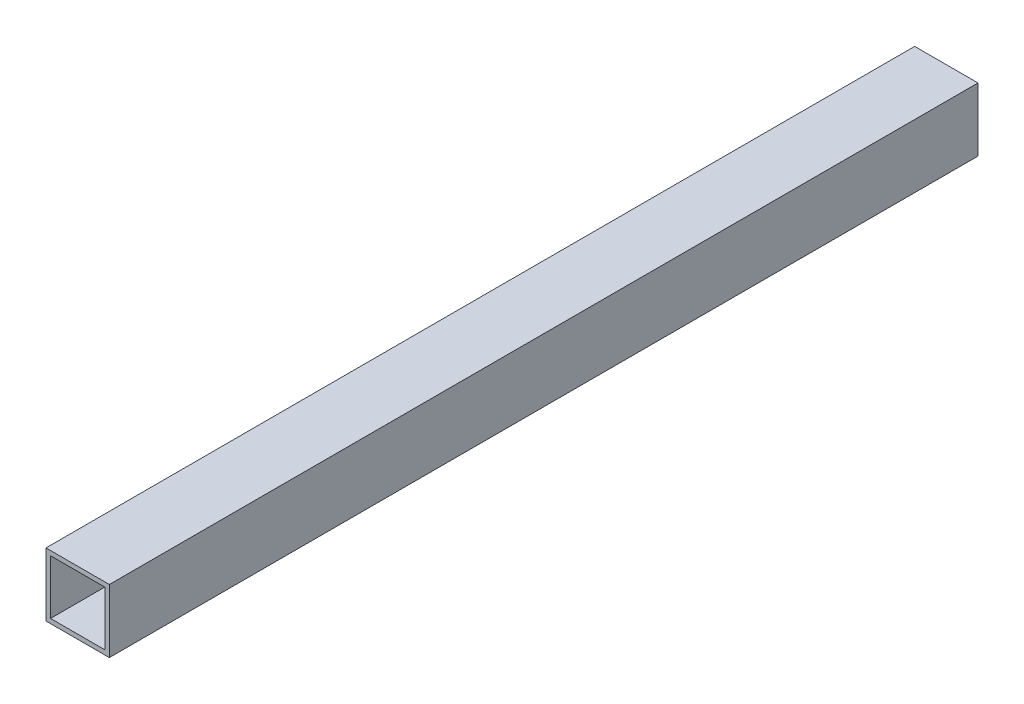
ISO-10303-21;
HEADER;
FILE_DESCRIPTION(('STEP AP214'),'2;1');
FILE_NAME('part.step','',(''),(''),'','','');
FILE_SCHEMA(('AUTOMOTIVE_DESIGN { 1 0 10303 214 1 1 1 1 }'));
ENDSEC;
DATA;
#1=APPLICATION_CONTEXT('core data for automotive mechanical design processes');
#2=APPLICATION_PROTOCOL_DEFINITION('international standard','automotive_design',2000,#1);
#3=PRODUCT_CONTEXT('',#1,'mechanical');
#4=PRODUCT('Part','Part','',(#3));
#5=PRODUCT_RELATED_PRODUCT_CATEGORY('part','',(#4));
#6=PRODUCT_DEFINITION_FORMATION('','',#4);
#7=PRODUCT_DEFINITION_CONTEXT('part definition',#1,'design');
#8=PRODUCT_DEFINITION('design','',#6,#7);
#9=PRODUCT_DEFINITION_SHAPE('','',#8);
#10=(LENGTH_UNIT() NAMED_UNIT(*) SI_UNIT(.MILLI.,.METRE.));
#11=(NAMED_UNIT(*) PLANE_ANGLE_UNIT() SI_UNIT($,.RADIAN.));
#12=(NAMED_UNIT(*) SI_UNIT($,.STERADIAN.) SOLID_ANGLE_UNIT());
#13=UNCERTAINTY_MEASURE_WITH_UNIT(LENGTH_MEASURE(1.E-05),#10,'distance_accuracy_value','');
#14=(GEOMETRIC_REPRESENTATION_CONTEXT(3) GLOBAL_UNCERTAINTY_ASSIGNED_CONTEXT((#13)) GLOBAL_UNIT_ASSIGNED_CONTEXT((#10,
#11,#12)) REPRESENTATION_CONTEXT('',''));
#15=CARTESIAN_POINT('',(0.,0.,0.));
#16=DIRECTION('',(0.,0.,1.));
#17=DIRECTION('',(1.,0.,0.));
#18=AXIS2_PLACEMENT_3D('',#15,#16,#17);
#19=CARTESIAN_POINT('',(0.,0.,609.6));
#20=DIRECTION('',(0.,0.,-1.));
#21=DIRECTION('',(-1.,0.,0.));
#22=AXIS2_PLACEMENT_3D('',#19,#20,#21);
#23=PLANE('',#22);
#24=DIRECTION('',(0.,-1.,0.));
#25=VECTOR('',#24,1.);
#26=CARTESIAN_POINT('',(0.,0.,609.6));
#27=LINE('',#26,#25);
#28=CARTESIAN_POINT('',(0.,44.45,609.6));
#29=VERTEX_POINT('',#28);
#30=CARTESIAN_POINT('',(0.,0.,609.6));
#31=VERTEX_POINT('',#30);
#32=EDGE_CURVE('E137',#29,#31,#27,.T.);
#33=ORIENTED_EDGE('',*,*,#32,.T.);
#34=DIRECTION('',(1.,0.,0.));
#35=VECTOR('',#34,1.);
#36=CARTESIAN_POINT('',(0.,0.,609.6));
#37=LINE('',#36,#35);
#38=CARTESIAN_POINT('',(44.45,0.,609.6));
#39=VERTEX_POINT('',#38);
#40=EDGE_CURVE('E140',#31,#39,#37,.T.);
#41=ORIENTED_EDGE('',*,*,#40,.T.);
#42=DIRECTION('',(0.,1.,0.));
#43=VECTOR('',#42,1.);
#44=CARTESIAN_POINT('',(44.45,0.,609.6));
#45=LINE('',#44,#43);
#46=CARTESIAN_POINT('',(44.45,44.45,609.6));
#47=VERTEX_POINT('',#46);
#48=EDGE_CURVE('E143',#39,#47,#45,.T.);
#49=ORIENTED_EDGE('',*,*,#48,.T.);
#50=DIRECTION('',(-1.,0.,0.));
#51=VECTOR('',#50,1.);
#52=CARTESIAN_POINT('',(0.,44.45,609.6));
#53=LINE('',#52,#51);
#54=EDGE_CURVE('E145',#47,#29,#53,.T.);
#55=ORIENTED_EDGE('',*,*,#54,.T.);
#56=EDGE_LOOP('',(#33,#41,#49,#55));
#57=FACE_BOUND('',#56,.T.);
#58=DIRECTION('',(1.,0.,0.));
#59=VECTOR('',#58,1.);
#60=CARTESIAN_POINT('',(3.175,3.175,609.6));
#61=LINE('',#60,#59);
#62=CARTESIAN_POINT('',(3.175,3.175,609.6));
#63=VERTEX_POINT('',#62);
#64=CARTESIAN_POINT('',(41.275,3.175,609.6));
#65=VERTEX_POINT('',#64);
#66=EDGE_CURVE('E101',#63,#65,#61,.T.);
#67=ORIENTED_EDGE('',*,*,#66,.F.);
#68=DIRECTION('',(0.,-1.,0.));
#69=VECTOR('',#68,1.);
#70=CARTESIAN_POINT('',(3.175,3.175,609.6));
#71=LINE('',#70,#69);
#72=CARTESIAN_POINT('',(3.175,41.275,609.6));
#73=VERTEX_POINT('',#72);
#74=EDGE_CURVE('E123',#73,#63,#71,.T.);
#75=ORIENTED_EDGE('',*,*,#74,.F.);
#76=DIRECTION('',(-1.,0.,0.));
#77=VECTOR('',#76,1.);
#78=CARTESIAN_POINT('',(3.175,41.275,609.6));
#79=LINE('',#78,#77);
#80=CARTESIAN_POINT('',(41.275,41.275,609.6));
#81=VERTEX_POINT('',#80);
#82=EDGE_CURVE('E121',#81,#73,#79,.T.);
#83=ORIENTED_EDGE('',*,*,#82,.F.);
#84=DIRECTION('',(0.,1.,0.));
#85=VECTOR('',#84,1.);
#86=CARTESIAN_POINT('',(41.275,3.175,609.6));
#87=LINE('',#86,#85);
#88=EDGE_CURVE('E109',#65,#81,#87,.T.);
#89=ORIENTED_EDGE('',*,*,#88,.F.);
#90=EDGE_LOOP('',(#67,#75,#83,#89));
#91=FACE_BOUND('',#90,.T.);
#92=ADVANCED_FACE('F36',(#57,#91),#23,.F.);
#93=CARTESIAN_POINT('',(0.,0.,0.));
#94=DIRECTION('',(0.,0.,-1.));
#95=DIRECTION('',(-1.,0.,0.));
#96=AXIS2_PLACEMENT_3D('',#93,#94,#95);
#97=PLANE('',#96);
#98=DIRECTION('',(0.,-1.,0.));
#99=VECTOR('',#98,1.);
#100=CARTESIAN_POINT('',(0.,0.,0.));
#101=LINE('',#100,#99);
#102=CARTESIAN_POINT('',(0.,44.45,0.));
#103=VERTEX_POINT('',#102);
#104=CARTESIAN_POINT('',(0.,0.,0.));
#105=VERTEX_POINT('',#104);
#106=EDGE_CURVE('E117',#103,#105,#101,.T.);
#107=ORIENTED_EDGE('',*,*,#106,.F.);
#108=DIRECTION('',(-1.,0.,0.));
#109=VECTOR('',#108,1.);
#110=CARTESIAN_POINT('',(0.,44.45,0.));
#111=LINE('',#110,#109);
#112=CARTESIAN_POINT('',(44.45,44.45,0.));
#113=VERTEX_POINT('',#112);
#114=EDGE_CURVE('E141',#113,#103,#111,.T.);
#115=ORIENTED_EDGE('',*,*,#114,.F.);
#116=DIRECTION('',(0.,1.,0.));
#117=VECTOR('',#116,1.);
#118=CARTESIAN_POINT('',(44.45,0.,0.));
#119=LINE('',#118,#117);
#120=CARTESIAN_POINT('',(44.45,0.,0.));
#121=VERTEX_POINT('',#120);
#122=EDGE_CURVE('E152',#121,#113,#119,.T.);
#123=ORIENTED_EDGE('',*,*,#122,.F.);
#124=DIRECTION('',(1.,0.,0.));
#125=VECTOR('',#124,1.);
#126=CARTESIAN_POINT('',(0.,0.,0.));
#127=LINE('',#126,#125);
#128=EDGE_CURVE('E150',#105,#121,#127,.T.);
#129=ORIENTED_EDGE('',*,*,#128,.F.);
#130=EDGE_LOOP('',(#107,#115,#123,#129));
#131=FACE_BOUND('',#130,.T.);
#132=DIRECTION('',(0.,-1.,0.));
#133=VECTOR('',#132,1.);
#134=CARTESIAN_POINT('',(3.175,3.175,0.));
#135=LINE('',#134,#133);
#136=CARTESIAN_POINT('',(3.175,41.275,0.));
#137=VERTEX_POINT('',#136);
#138=CARTESIAN_POINT('',(3.175,3.175,0.));
#139=VERTEX_POINT('',#138);
#140=EDGE_CURVE('E110',#137,#139,#135,.T.);
#141=ORIENTED_EDGE('',*,*,#140,.T.);
#142=DIRECTION('',(1.,0.,0.));
#143=VECTOR('',#142,1.);
#144=CARTESIAN_POINT('',(3.175,3.175,0.));
#145=LINE('',#144,#143);
#146=CARTESIAN_POINT('',(41.275,3.175,0.));
#147=VERTEX_POINT('',#146);
#148=EDGE_CURVE('E59',#139,#147,#145,.T.);
#149=ORIENTED_EDGE('',*,*,#148,.T.);
#150=DIRECTION('',(0.,1.,0.));
#151=VECTOR('',#150,1.);
#152=CARTESIAN_POINT('',(41.275,3.175,0.));
#153=LINE('',#152,#151);
#154=CARTESIAN_POINT('',(41.275,41.275,0.));
#155=VERTEX_POINT('',#154);
#156=EDGE_CURVE('E116',#147,#155,#153,.T.);
#157=ORIENTED_EDGE('',*,*,#156,.T.);
#158=DIRECTION('',(-1.,0.,0.));
#159=VECTOR('',#158,1.);
#160=CARTESIAN_POINT('',(3.175,41.275,0.));
#161=LINE('',#160,#159);
#162=EDGE_CURVE('E129',#155,#137,#161,.T.);
#163=ORIENTED_EDGE('',*,*,#162,.T.);
#164=EDGE_LOOP('',(#141,#149,#157,#163));
#165=FACE_BOUND('',#164,.T.);
#166=ADVANCED_FACE('F170',(#131,#165),#97,.T.);
#167=CARTESIAN_POINT('',(0.,0.,609.6));
#168=DIRECTION('',(1.,0.,0.));
#169=DIRECTION('',(0.,0.,-1.));
#170=AXIS2_PLACEMENT_3D('',#167,#168,#169);
#171=PLANE('',#170);
#172=ORIENTED_EDGE('',*,*,#106,.T.);
#173=DIRECTION('',(0.,0.,-1.));
#174=VECTOR('',#173,1.);
#175=CARTESIAN_POINT('',(0.,0.,609.6));
#176=LINE('',#175,#174);
#177=EDGE_CURVE('E11',#31,#105,#176,.T.);
#178=ORIENTED_EDGE('',*,*,#177,.F.);
#179=ORIENTED_EDGE('',*,*,#32,.F.);
#180=DIRECTION('',(0.,0.,-1.));
#181=VECTOR('',#180,1.);
#182=CARTESIAN_POINT('',(0.,44.45,609.6));
#183=LINE('',#182,#181);
#184=EDGE_CURVE('E147',#29,#103,#183,.T.);
#185=ORIENTED_EDGE('',*,*,#184,.T.);
#186=EDGE_LOOP('',(#172,#178,#179,#185));
#187=FACE_BOUND('',#186,.T.);
#188=ADVANCED_FACE('F38',(#187),#171,.F.);
#189=CARTESIAN_POINT('',(0.,0.,609.6));
#190=DIRECTION('',(0.,1.,0.));
#191=DIRECTION('',(0.,0.,1.));
#192=AXIS2_PLACEMENT_3D('',#189,#190,#191);
#193=PLANE('',#192);
#194=ORIENTED_EDGE('',*,*,#128,.T.);
#195=DIRECTION('',(0.,0.,-1.));
#196=VECTOR('',#195,1.);
#197=CARTESIAN_POINT('',(44.45,0.,609.6));
#198=LINE('',#197,#196);
#199=EDGE_CURVE('E44',#39,#121,#198,.T.);
#200=ORIENTED_EDGE('',*,*,#199,.F.);
#201=ORIENTED_EDGE('',*,*,#40,.F.);
#202=ORIENTED_EDGE('',*,*,#177,.T.);
#203=EDGE_LOOP('',(#194,#200,#201,#202));
#204=FACE_BOUND('',#203,.T.);
#205=ADVANCED_FACE('F180',(#204),#193,.F.);
#206=CARTESIAN_POINT('',(44.45,0.,609.6));
#207=DIRECTION('',(-1.,0.,0.));
#208=DIRECTION('',(0.,0.,1.));
#209=AXIS2_PLACEMENT_3D('',#206,#207,#208);
#210=PLANE('',#209);
#211=ORIENTED_EDGE('',*,*,#122,.T.);
#212=DIRECTION('',(0.,0.,-1.));
#213=VECTOR('',#212,1.);
#214=CARTESIAN_POINT('',(44.45,44.45,609.6));
#215=LINE('',#214,#213);
#216=EDGE_CURVE('E157',#47,#113,#215,.T.);
#217=ORIENTED_EDGE('',*,*,#216,.F.);
#218=ORIENTED_EDGE('',*,*,#48,.F.);
#219=ORIENTED_EDGE('',*,*,#199,.T.);
#220=EDGE_LOOP('',(#211,#217,#218,#219));
#221=FACE_BOUND('',#220,.T.);
#222=ADVANCED_FACE('F164',(#221),#210,.F.);
#223=CARTESIAN_POINT('',(0.,44.45,609.6));
#224=DIRECTION('',(0.,-1.,0.));
#225=DIRECTION('',(0.,0.,-1.));
#226=AXIS2_PLACEMENT_3D('',#223,#224,#225);
#227=PLANE('',#226);
#228=ORIENTED_EDGE('',*,*,#114,.T.);
#229=ORIENTED_EDGE('',*,*,#184,.F.);
#230=ORIENTED_EDGE('',*,*,#54,.F.);
#231=ORIENTED_EDGE('',*,*,#216,.T.);
#232=EDGE_LOOP('',(#228,#229,#230,#231));
#233=FACE_BOUND('',#232,.T.);
#234=ADVANCED_FACE('F174',(#233),#227,.F.);
#235=CARTESIAN_POINT('',(3.175,3.175,609.6));
#236=DIRECTION('',(0.,1.,0.));
#237=DIRECTION('',(0.,0.,1.));
#238=AXIS2_PLACEMENT_3D('',#235,#236,#237);
#239=PLANE('',#238);
#240=ORIENTED_EDGE('',*,*,#148,.F.);
#241=DIRECTION('',(0.,0.,-1.));
#242=VECTOR('',#241,1.);
#243=CARTESIAN_POINT('',(3.175,3.175,609.6));
#244=LINE('',#243,#242);
#245=EDGE_CURVE('E105',#63,#139,#244,.T.);
#246=ORIENTED_EDGE('',*,*,#245,.F.);
#247=ORIENTED_EDGE('',*,*,#66,.T.);
#248=DIRECTION('',(0.,0.,-1.));
#249=VECTOR('',#248,1.);
#250=CARTESIAN_POINT('',(41.275,3.175,609.6));
#251=LINE('',#250,#249);
#252=EDGE_CURVE('E104',#65,#147,#251,.T.);
#253=ORIENTED_EDGE('',*,*,#252,.T.);
#254=EDGE_LOOP('',(#240,#246,#247,#253));
#255=FACE_BOUND('',#254,.T.);
#256=ADVANCED_FACE('F103',(#255),#239,.T.);
#257=CARTESIAN_POINT('',(41.275,3.175,609.6));
#258=DIRECTION('',(-1.,0.,0.));
#259=DIRECTION('',(0.,0.,1.));
#260=AXIS2_PLACEMENT_3D('',#257,#258,#259);
#261=PLANE('',#260);
#262=ORIENTED_EDGE('',*,*,#156,.F.);
#263=ORIENTED_EDGE('',*,*,#252,.F.);
#264=ORIENTED_EDGE('',*,*,#88,.T.);
#265=DIRECTION('',(0.,0.,-1.));
#266=VECTOR('',#265,1.);
#267=CARTESIAN_POINT('',(41.275,41.275,609.6));
#268=LINE('',#267,#266);
#269=EDGE_CURVE('E118',#81,#155,#268,.T.);
#270=ORIENTED_EDGE('',*,*,#269,.T.);
#271=EDGE_LOOP('',(#262,#263,#264,#270));
#272=FACE_BOUND('',#271,.T.);
#273=ADVANCED_FACE('F113',(#272),#261,.T.);
#274=CARTESIAN_POINT('',(3.175,41.275,609.6));
#275=DIRECTION('',(0.,-1.,0.));
#276=DIRECTION('',(0.,0.,-1.));
#277=AXIS2_PLACEMENT_3D('',#274,#275,#276);
#278=PLANE('',#277);
#279=ORIENTED_EDGE('',*,*,#162,.F.);
#280=ORIENTED_EDGE('',*,*,#269,.F.);
#281=ORIENTED_EDGE('',*,*,#82,.T.);
#282=DIRECTION('',(0.,0.,-1.));
#283=VECTOR('',#282,1.);
#284=CARTESIAN_POINT('',(3.175,41.275,609.6));
#285=LINE('',#284,#283);
#286=EDGE_CURVE('E51',#73,#137,#285,.T.);
#287=ORIENTED_EDGE('',*,*,#286,.T.);
#288=EDGE_LOOP('',(#279,#280,#281,#287));
#289=FACE_BOUND('',#288,.T.);
#290=ADVANCED_FACE('F203',(#289),#278,.T.);
#291=CARTESIAN_POINT('',(3.175,3.175,609.6));
#292=DIRECTION('',(1.,0.,0.));
#293=DIRECTION('',(0.,0.,-1.));
#294=AXIS2_PLACEMENT_3D('',#291,#292,#293);
#295=PLANE('',#294);
#296=ORIENTED_EDGE('',*,*,#140,.F.);
#297=ORIENTED_EDGE('',*,*,#286,.F.);
#298=ORIENTED_EDGE('',*,*,#74,.T.);
#299=ORIENTED_EDGE('',*,*,#245,.T.);
#300=EDGE_LOOP('',(#296,#297,#298,#299));
#301=FACE_BOUND('',#300,.T.);
#302=ADVANCED_FACE('F207',(#301),#295,.T.);
#303=CLOSED_SHELL('',(#92,#166,#188,#205,#222,#234,#256,#273,#290,#302));
#304=MANIFOLD_SOLID_BREP('B2',#303);
#305=ADVANCED_BREP_SHAPE_REPRESENTATION('',(#18,#304),#14);
#306=SHAPE_DEFINITION_REPRESENTATION(#9,#305);
ENDSEC;
END-ISO-10303-21;
